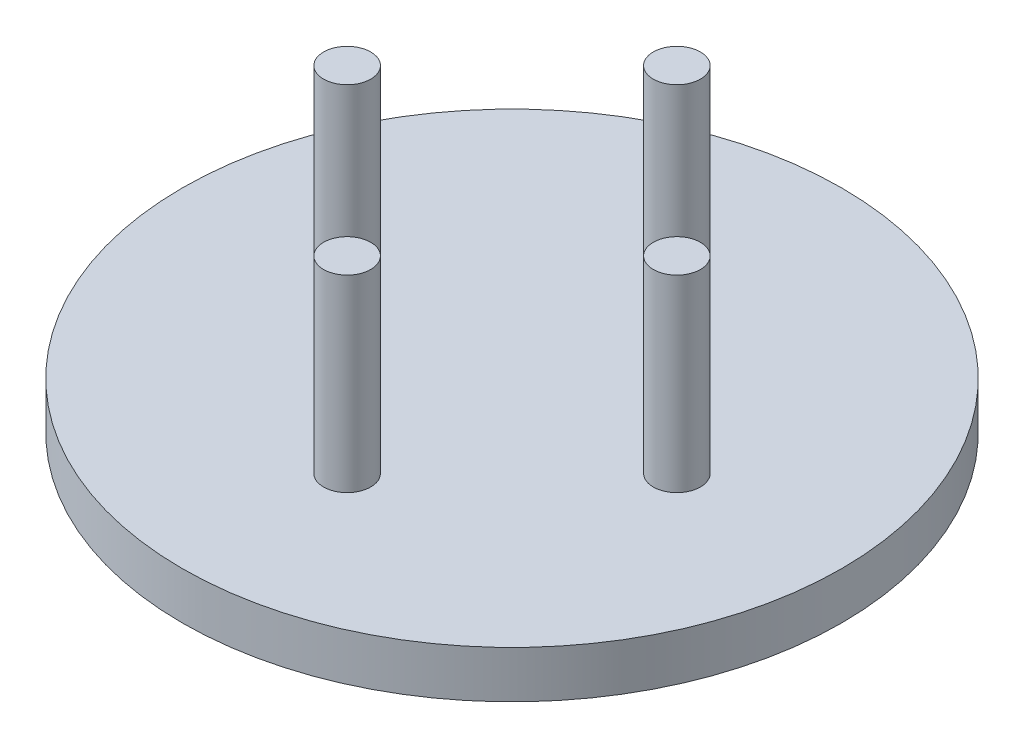
ISO-10303-21;
HEADER;
FILE_DESCRIPTION(('STEP AP214'),'2;1');
FILE_NAME('part.step','',(''),(''),'','','');
FILE_SCHEMA(('AUTOMOTIVE_DESIGN { 1 0 10303 214 1 1 1 1 }'));
ENDSEC;
DATA;
#1=APPLICATION_CONTEXT('core data for automotive mechanical design processes');
#2=APPLICATION_PROTOCOL_DEFINITION('international standard','automotive_design',2000,#1);
#3=PRODUCT_CONTEXT('',#1,'mechanical');
#4=PRODUCT('Part','Part','',(#3));
#5=PRODUCT_RELATED_PRODUCT_CATEGORY('part','',(#4));
#6=PRODUCT_DEFINITION_FORMATION('','',#4);
#7=PRODUCT_DEFINITION_CONTEXT('part definition',#1,'design');
#8=PRODUCT_DEFINITION('design','',#6,#7);
#9=PRODUCT_DEFINITION_SHAPE('','',#8);
#10=(LENGTH_UNIT() NAMED_UNIT(*) SI_UNIT(.MILLI.,.METRE.));
#11=(NAMED_UNIT(*) PLANE_ANGLE_UNIT() SI_UNIT($,.RADIAN.));
#12=(NAMED_UNIT(*) SI_UNIT($,.STERADIAN.) SOLID_ANGLE_UNIT());
#13=UNCERTAINTY_MEASURE_WITH_UNIT(LENGTH_MEASURE(1.E-05),#10,'distance_accuracy_value','');
#14=(GEOMETRIC_REPRESENTATION_CONTEXT(3) GLOBAL_UNCERTAINTY_ASSIGNED_CONTEXT((#13)) GLOBAL_UNIT_ASSIGNED_CONTEXT((#10,
#11,#12)) REPRESENTATION_CONTEXT('',''));
#15=CARTESIAN_POINT('',(0.,0.,0.));
#16=DIRECTION('',(0.,0.,1.));
#17=DIRECTION('',(1.,0.,0.));
#18=AXIS2_PLACEMENT_3D('',#15,#16,#17);
#19=CARTESIAN_POINT('',(0.,12.7,0.));
#20=DIRECTION('',(0.,1.,0.));
#21=DIRECTION('',(0.,0.,1.));
#22=AXIS2_PLACEMENT_3D('',#19,#20,#21);
#23=PLANE('',#22);
#24=CARTESIAN_POINT('',(88.9,12.7,0.));
#25=DIRECTION('',(0.,1.,0.));
#26=DIRECTION('',(0.,0.,1.));
#27=AXIS2_PLACEMENT_3D('',#24,#25,#26);
#28=CIRCLE('',#27,12.7);
#29=CARTESIAN_POINT('',(88.9,12.7,12.7));
#30=VERTEX_POINT('',#29);
#31=EDGE_CURVE('E61',#30,#30,#28,.T.);
#32=ORIENTED_EDGE('',*,*,#31,.F.);
#33=EDGE_LOOP('',(#32));
#34=FACE_BOUND('',#33,.T.);
#35=CARTESIAN_POINT('',(0.,12.7,-88.9));
#36=DIRECTION('',(0.,1.,0.));
#37=DIRECTION('',(0.,0.,1.));
#38=AXIS2_PLACEMENT_3D('',#35,#36,#37);
#39=CIRCLE('',#38,12.7);
#40=CARTESIAN_POINT('',(0.,12.7,-76.2));
#41=VERTEX_POINT('',#40);
#42=EDGE_CURVE('E49',#41,#41,#39,.T.);
#43=ORIENTED_EDGE('',*,*,#42,.F.);
#44=EDGE_LOOP('',(#43));
#45=FACE_BOUND('',#44,.T.);
#46=CARTESIAN_POINT('',(0.,12.7,0.));
#47=DIRECTION('',(0.,1.,0.));
#48=DIRECTION('',(0.,0.,1.));
#49=AXIS2_PLACEMENT_3D('',#46,#47,#48);
#50=CIRCLE('',#49,177.8);
#51=CARTESIAN_POINT('',(0.,12.7,177.8));
#52=VERTEX_POINT('',#51);
#53=EDGE_CURVE('E10',#52,#52,#50,.T.);
#54=ORIENTED_EDGE('',*,*,#53,.T.);
#55=EDGE_LOOP('',(#54));
#56=FACE_BOUND('',#55,.T.);
#57=CARTESIAN_POINT('',(0.,12.7,88.9));
#58=DIRECTION('',(0.,1.,0.));
#59=DIRECTION('',(0.,0.,1.));
#60=AXIS2_PLACEMENT_3D('',#57,#58,#59);
#61=CIRCLE('',#60,12.7);
#62=CARTESIAN_POINT('',(0.,12.7,101.6));
#63=VERTEX_POINT('',#62);
#64=EDGE_CURVE('E55',#63,#63,#61,.T.);
#65=ORIENTED_EDGE('',*,*,#64,.F.);
#66=EDGE_LOOP('',(#65));
#67=FACE_BOUND('',#66,.T.);
#68=CARTESIAN_POINT('',(-88.9,12.7,0.));
#69=DIRECTION('',(0.,1.,0.));
#70=DIRECTION('',(0.,0.,1.));
#71=AXIS2_PLACEMENT_3D('',#68,#69,#70);
#72=CIRCLE('',#71,12.7);
#73=CARTESIAN_POINT('',(-88.9,12.7,12.7));
#74=VERTEX_POINT('',#73);
#75=EDGE_CURVE('E67',#74,#74,#72,.T.);
#76=ORIENTED_EDGE('',*,*,#75,.F.);
#77=EDGE_LOOP('',(#76));
#78=FACE_BOUND('',#77,.T.);
#79=ADVANCED_FACE('F36',(#34,#45,#56,#67,#78),#23,.T.);
#80=CARTESIAN_POINT('',(0.,12.7,0.));
#81=DIRECTION('',(0.,-1.,0.));
#82=DIRECTION('',(0.,0.,-1.));
#83=AXIS2_PLACEMENT_3D('',#80,#81,#82);
#84=CYLINDRICAL_SURFACE('',#83,177.8);
#85=ORIENTED_EDGE('',*,*,#53,.F.);
#86=EDGE_LOOP('',(#85));
#87=FACE_BOUND('',#86,.T.);
#88=CARTESIAN_POINT('',(0.,-12.7,0.));
#89=DIRECTION('',(0.,1.,0.));
#90=DIRECTION('',(0.,0.,1.));
#91=AXIS2_PLACEMENT_3D('',#88,#89,#90);
#92=CIRCLE('',#91,177.8);
#93=CARTESIAN_POINT('',(0.,-12.7,177.8));
#94=VERTEX_POINT('',#93);
#95=EDGE_CURVE('E40',#94,#94,#92,.T.);
#96=ORIENTED_EDGE('',*,*,#95,.T.);
#97=EDGE_LOOP('',(#96));
#98=FACE_BOUND('',#97,.T.);
#99=ADVANCED_FACE('F38',(#87,#98),#84,.T.);
#100=CARTESIAN_POINT('',(0.,-12.7,0.));
#101=DIRECTION('',(0.,1.,0.));
#102=DIRECTION('',(0.,0.,1.));
#103=AXIS2_PLACEMENT_3D('',#100,#101,#102);
#104=PLANE('',#103);
#105=ORIENTED_EDGE('',*,*,#95,.F.);
#106=EDGE_LOOP('',(#105));
#107=FACE_BOUND('',#106,.T.);
#108=ADVANCED_FACE('F88',(#107),#104,.F.);
#109=CARTESIAN_POINT('',(0.,114.3,-88.9));
#110=DIRECTION('',(0.,-1.,0.));
#111=DIRECTION('',(0.,0.,-1.));
#112=AXIS2_PLACEMENT_3D('',#109,#110,#111);
#113=CYLINDRICAL_SURFACE('',#112,12.7);
#114=CARTESIAN_POINT('',(0.,114.3,-88.9));
#115=DIRECTION('',(0.,1.,0.));
#116=DIRECTION('',(0.,0.,1.));
#117=AXIS2_PLACEMENT_3D('',#114,#115,#116);
#118=CIRCLE('',#117,12.7);
#119=CARTESIAN_POINT('',(0.,114.3,-76.2));
#120=VERTEX_POINT('',#119);
#121=EDGE_CURVE('E47',#120,#120,#118,.T.);
#122=ORIENTED_EDGE('',*,*,#121,.F.);
#123=EDGE_LOOP('',(#122));
#124=FACE_BOUND('',#123,.T.);
#125=ORIENTED_EDGE('',*,*,#42,.T.);
#126=EDGE_LOOP('',(#125));
#127=FACE_BOUND('',#126,.T.);
#128=ADVANCED_FACE('F93',(#124,#127),#113,.T.);
#129=CARTESIAN_POINT('',(0.,114.3,-88.9));
#130=DIRECTION('',(0.,1.,0.));
#131=DIRECTION('',(0.,0.,1.));
#132=AXIS2_PLACEMENT_3D('',#129,#130,#131);
#133=PLANE('',#132);
#134=ORIENTED_EDGE('',*,*,#121,.T.);
#135=EDGE_LOOP('',(#134));
#136=FACE_BOUND('',#135,.T.);
#137=ADVANCED_FACE('F100',(#136),#133,.T.);
#138=CARTESIAN_POINT('',(0.,114.3,88.9));
#139=DIRECTION('',(0.,-1.,0.));
#140=DIRECTION('',(0.,0.,-1.));
#141=AXIS2_PLACEMENT_3D('',#138,#139,#140);
#142=CYLINDRICAL_SURFACE('',#141,12.7);
#143=CARTESIAN_POINT('',(0.,114.3,88.9));
#144=DIRECTION('',(0.,1.,0.));
#145=DIRECTION('',(0.,0.,1.));
#146=AXIS2_PLACEMENT_3D('',#143,#144,#145);
#147=CIRCLE('',#146,12.7);
#148=CARTESIAN_POINT('',(0.,114.3,101.6));
#149=VERTEX_POINT('',#148);
#150=EDGE_CURVE('E52',#149,#149,#147,.T.);
#151=ORIENTED_EDGE('',*,*,#150,.F.);
#152=EDGE_LOOP('',(#151));
#153=FACE_BOUND('',#152,.T.);
#154=ORIENTED_EDGE('',*,*,#64,.T.);
#155=EDGE_LOOP('',(#154));
#156=FACE_BOUND('',#155,.T.);
#157=ADVANCED_FACE('F107',(#153,#156),#142,.T.);
#158=CARTESIAN_POINT('',(0.,114.3,88.9));
#159=DIRECTION('',(0.,1.,0.));
#160=DIRECTION('',(0.,0.,1.));
#161=AXIS2_PLACEMENT_3D('',#158,#159,#160);
#162=PLANE('',#161);
#163=ORIENTED_EDGE('',*,*,#150,.T.);
#164=EDGE_LOOP('',(#163));
#165=FACE_BOUND('',#164,.T.);
#166=ADVANCED_FACE('F116',(#165),#162,.T.);
#167=CARTESIAN_POINT('',(88.9,114.3,0.));
#168=DIRECTION('',(0.,-1.,0.));
#169=DIRECTION('',(0.,0.,-1.));
#170=AXIS2_PLACEMENT_3D('',#167,#168,#169);
#171=CYLINDRICAL_SURFACE('',#170,12.7);
#172=CARTESIAN_POINT('',(88.9,114.3,0.));
#173=DIRECTION('',(0.,1.,0.));
#174=DIRECTION('',(0.,0.,1.));
#175=AXIS2_PLACEMENT_3D('',#172,#173,#174);
#176=CIRCLE('',#175,12.7);
#177=CARTESIAN_POINT('',(88.9,114.3,12.7));
#178=VERTEX_POINT('',#177);
#179=EDGE_CURVE('E58',#178,#178,#176,.T.);
#180=ORIENTED_EDGE('',*,*,#179,.F.);
#181=EDGE_LOOP('',(#180));
#182=FACE_BOUND('',#181,.T.);
#183=ORIENTED_EDGE('',*,*,#31,.T.);
#184=EDGE_LOOP('',(#183));
#185=FACE_BOUND('',#184,.T.);
#186=ADVANCED_FACE('F122',(#182,#185),#171,.T.);
#187=CARTESIAN_POINT('',(88.9,114.3,0.));
#188=DIRECTION('',(0.,1.,0.));
#189=DIRECTION('',(0.,0.,1.));
#190=AXIS2_PLACEMENT_3D('',#187,#188,#189);
#191=PLANE('',#190);
#192=ORIENTED_EDGE('',*,*,#179,.T.);
#193=EDGE_LOOP('',(#192));
#194=FACE_BOUND('',#193,.T.);
#195=ADVANCED_FACE('F78',(#194),#191,.T.);
#196=CARTESIAN_POINT('',(-88.9,114.3,0.));
#197=DIRECTION('',(0.,-1.,0.));
#198=DIRECTION('',(0.,0.,-1.));
#199=AXIS2_PLACEMENT_3D('',#196,#197,#198);
#200=CYLINDRICAL_SURFACE('',#199,12.7);
#201=CARTESIAN_POINT('',(-88.9,114.3,0.));
#202=DIRECTION('',(0.,1.,0.));
#203=DIRECTION('',(0.,0.,1.));
#204=AXIS2_PLACEMENT_3D('',#201,#202,#203);
#205=CIRCLE('',#204,12.7);
#206=CARTESIAN_POINT('',(-88.9,114.3,12.7));
#207=VERTEX_POINT('',#206);
#208=EDGE_CURVE('E64',#207,#207,#205,.T.);
#209=ORIENTED_EDGE('',*,*,#208,.F.);
#210=EDGE_LOOP('',(#209));
#211=FACE_BOUND('',#210,.T.);
#212=ORIENTED_EDGE('',*,*,#75,.T.);
#213=EDGE_LOOP('',(#212));
#214=FACE_BOUND('',#213,.T.);
#215=ADVANCED_FACE('F75',(#211,#214),#200,.T.);
#216=CARTESIAN_POINT('',(-88.9,114.3,0.));
#217=DIRECTION('',(0.,1.,0.));
#218=DIRECTION('',(0.,0.,1.));
#219=AXIS2_PLACEMENT_3D('',#216,#217,#218);
#220=PLANE('',#219);
#221=ORIENTED_EDGE('',*,*,#208,.T.);
#222=EDGE_LOOP('',(#221));
#223=FACE_BOUND('',#222,.T.);
#224=ADVANCED_FACE('F73',(#223),#220,.T.);
#225=CLOSED_SHELL('',(#79,#99,#108,#128,#137,#157,#166,#186,#195,#215,#224));
#226=MANIFOLD_SOLID_BREP('B2',#225);
#227=ADVANCED_BREP_SHAPE_REPRESENTATION('',(#18,#226),#14);
#228=SHAPE_DEFINITION_REPRESENTATION(#9,#227);
ENDSEC;
END-ISO-10303-21;
